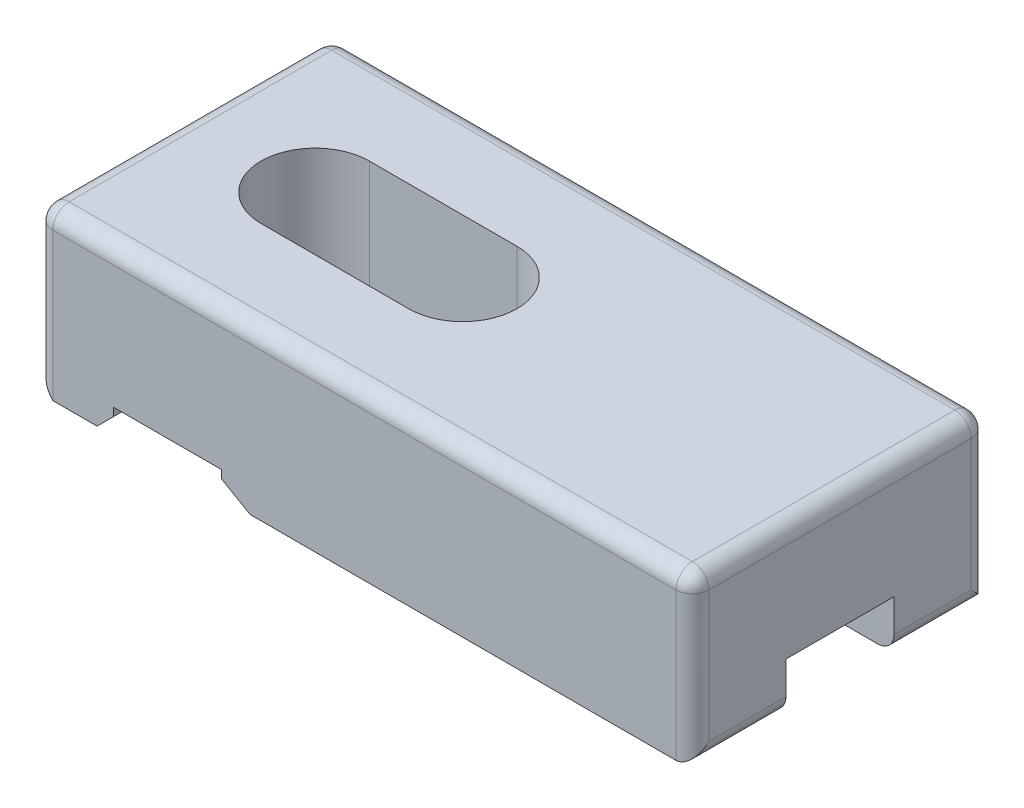
ISO-10303-21;
HEADER;
FILE_DESCRIPTION(('STEP AP214'),'2;1');
FILE_NAME('part.step','',(''),(''),'','','');
FILE_SCHEMA(('AUTOMOTIVE_DESIGN { 1 0 10303 214 1 1 1 1 }'));
ENDSEC;
DATA;
#1=APPLICATION_CONTEXT('core data for automotive mechanical design processes');
#2=APPLICATION_PROTOCOL_DEFINITION('international standard','automotive_design',2000,#1);
#3=PRODUCT_CONTEXT('',#1,'mechanical');
#4=PRODUCT('Part','Part','',(#3));
#5=PRODUCT_RELATED_PRODUCT_CATEGORY('part','',(#4));
#6=PRODUCT_DEFINITION_FORMATION('','',#4);
#7=PRODUCT_DEFINITION_CONTEXT('part definition',#1,'design');
#8=PRODUCT_DEFINITION('design','',#6,#7);
#9=PRODUCT_DEFINITION_SHAPE('','',#8);
#10=(LENGTH_UNIT() NAMED_UNIT(*) SI_UNIT(.MILLI.,.METRE.));
#11=(NAMED_UNIT(*) PLANE_ANGLE_UNIT() SI_UNIT($,.RADIAN.));
#12=(NAMED_UNIT(*) SI_UNIT($,.STERADIAN.) SOLID_ANGLE_UNIT());
#13=UNCERTAINTY_MEASURE_WITH_UNIT(LENGTH_MEASURE(1.E-05),#10,'distance_accuracy_value','');
#14=(GEOMETRIC_REPRESENTATION_CONTEXT(3) GLOBAL_UNCERTAINTY_ASSIGNED_CONTEXT((#13)) GLOBAL_UNIT_ASSIGNED_CONTEXT((#10,
#11,#12)) REPRESENTATION_CONTEXT('',''));
#15=CARTESIAN_POINT('',(0.,0.,0.));
#16=DIRECTION('',(0.,0.,1.));
#17=DIRECTION('',(1.,0.,0.));
#18=AXIS2_PLACEMENT_3D('',#15,#16,#17);
#19=CARTESIAN_POINT('',(0.,0.,0.));
#20=DIRECTION('',(0.,-1.,0.));
#21=DIRECTION('',(0.,0.,-1.));
#22=AXIS2_PLACEMENT_3D('',#19,#20,#21);
#23=PLANE('',#22);
#24=DIRECTION('',(-1.,0.,0.));
#25=VECTOR('',#24,1.);
#26=CARTESIAN_POINT('',(0.,0.,-5.7));
#27=LINE('',#26,#25);
#28=CARTESIAN_POINT('',(3.7,0.,-5.7));
#29=VERTEX_POINT('',#28);
#30=CARTESIAN_POINT('',(1.,0.,-5.7));
#31=VERTEX_POINT('',#30);
#32=EDGE_CURVE('E277',#29,#31,#27,.T.);
#33=ORIENTED_EDGE('',*,*,#32,.F.);
#34=DIRECTION('',(0.,0.,1.));
#35=VECTOR('',#34,1.);
#36=CARTESIAN_POINT('',(3.7,0.,0.));
#37=LINE('',#36,#35);
#38=CARTESIAN_POINT('',(3.7,0.,0.));
#39=VERTEX_POINT('',#38);
#40=EDGE_CURVE('E412',#29,#39,#37,.T.);
#41=ORIENTED_EDGE('',*,*,#40,.T.);
#42=DIRECTION('',(1.,0.,0.));
#43=VECTOR('',#42,1.);
#44=CARTESIAN_POINT('',(0.,0.,0.));
#45=LINE('',#44,#43);
#46=CARTESIAN_POINT('',(1.,0.,0.));
#47=VERTEX_POINT('',#46);
#48=EDGE_CURVE('E363',#47,#39,#45,.T.);
#49=ORIENTED_EDGE('',*,*,#48,.F.);
#50=DIRECTION('',(0.,0.,-1.));
#51=VECTOR('',#50,1.);
#52=CARTESIAN_POINT('',(1.,0.,-5.7));
#53=LINE('',#52,#51);
#54=EDGE_CURVE('E409',#47,#31,#53,.T.);
#55=ORIENTED_EDGE('',*,*,#54,.T.);
#56=EDGE_LOOP('',(#33,#41,#49,#55));
#57=FACE_BOUND('',#56,.T.);
#58=ADVANCED_FACE('F39',(#57),#23,.T.);
#59=DIRECTION('',(-1.,0.,0.));
#60=VECTOR('',#59,1.);
#61=CARTESIAN_POINT('',(0.,0.,-18.));
#62=LINE('',#61,#60);
#63=CARTESIAN_POINT('',(39.,0.,-18.));
#64=VERTEX_POINT('',#63);
#65=CARTESIAN_POINT('',(13.0320508075689,0.,-18.));
#66=VERTEX_POINT('',#65);
#67=EDGE_CURVE('E368',#64,#66,#62,.T.);
#68=ORIENTED_EDGE('',*,*,#67,.F.);
#69=DIRECTION('',(0.,0.,-1.));
#70=VECTOR('',#69,1.);
#71=CARTESIAN_POINT('',(39.,0.,-12.3));
#72=LINE('',#71,#70);
#73=CARTESIAN_POINT('',(39.,0.,-12.3));
#74=VERTEX_POINT('',#73);
#75=EDGE_CURVE('E65',#64,#74,#72,.F.);
#76=ORIENTED_EDGE('',*,*,#75,.T.);
#77=DIRECTION('',(-1.,0.,0.));
#78=VECTOR('',#77,1.);
#79=CARTESIAN_POINT('',(17.,0.,-12.3));
#80=LINE('',#79,#78);
#81=CARTESIAN_POINT('',(13.0320508075689,0.,-12.3));
#82=VERTEX_POINT('',#81);
#83=EDGE_CURVE('E327',#74,#82,#80,.T.);
#84=ORIENTED_EDGE('',*,*,#83,.T.);
#85=DIRECTION('',(0.,0.,-1.));
#86=VECTOR('',#85,1.);
#87=CARTESIAN_POINT('',(13.0320508075689,0.,-18.));
#88=LINE('',#87,#86);
#89=EDGE_CURVE('E432',#82,#66,#88,.T.);
#90=ORIENTED_EDGE('',*,*,#89,.T.);
#91=EDGE_LOOP('',(#68,#76,#84,#90));
#92=FACE_BOUND('',#91,.T.);
#93=ADVANCED_FACE('F723',(#92),#23,.T.);
#94=DIRECTION('',(1.,0.,0.));
#95=VECTOR('',#94,1.);
#96=CARTESIAN_POINT('',(17.,0.,-5.7));
#97=LINE('',#96,#95);
#98=CARTESIAN_POINT('',(13.0320508075689,0.,-5.7));
#99=VERTEX_POINT('',#98);
#100=CARTESIAN_POINT('',(39.,0.,-5.7));
#101=VERTEX_POINT('',#100);
#102=EDGE_CURVE('E332',#99,#101,#97,.T.);
#103=ORIENTED_EDGE('',*,*,#102,.T.);
#104=DIRECTION('',(0.,0.,-1.));
#105=VECTOR('',#104,1.);
#106=CARTESIAN_POINT('',(39.,0.,0.));
#107=LINE('',#106,#105);
#108=CARTESIAN_POINT('',(39.,0.,0.));
#109=VERTEX_POINT('',#108);
#110=EDGE_CURVE('E514',#101,#109,#107,.F.);
#111=ORIENTED_EDGE('',*,*,#110,.T.);
#112=CARTESIAN_POINT('',(13.0320508075689,0.,0.));
#113=VERTEX_POINT('',#112);
#114=EDGE_CURVE('E362',#113,#109,#45,.T.);
#115=ORIENTED_EDGE('',*,*,#114,.F.);
#116=DIRECTION('',(0.,0.,-1.));
#117=VECTOR('',#116,1.);
#118=CARTESIAN_POINT('',(13.0320508075689,0.,-5.7));
#119=LINE('',#118,#117);
#120=EDGE_CURVE('E446',#113,#99,#119,.T.);
#121=ORIENTED_EDGE('',*,*,#120,.T.);
#122=EDGE_LOOP('',(#103,#111,#115,#121));
#123=FACE_BOUND('',#122,.T.);
#124=ADVANCED_FACE('F728',(#123),#23,.T.);
#125=CARTESIAN_POINT('',(8.,10.,-9.));
#126=DIRECTION('',(0.,-1.,0.));
#127=DIRECTION('',(0.,0.,-1.));
#128=AXIS2_PLACEMENT_3D('',#125,#126,#127);
#129=CYLINDRICAL_SURFACE('',#128,3.3);
#130=DIRECTION('',(0.,-1.,0.));
#131=VECTOR('',#130,1.);
#132=CARTESIAN_POINT('',(8.,10.,-5.7));
#133=LINE('',#132,#131);
#134=CARTESIAN_POINT('',(8.,10.,-5.7));
#135=VERTEX_POINT('',#134);
#136=CARTESIAN_POINT('',(8.,1.5,-5.7));
#137=VERTEX_POINT('',#136);
#138=EDGE_CURVE('E350',#135,#137,#133,.T.);
#139=ORIENTED_EDGE('',*,*,#138,.T.);
#140=CARTESIAN_POINT('',(8.,1.5,-9.));
#141=DIRECTION('',(0.,-1.,0.));
#142=DIRECTION('',(0.,0.,-1.));
#143=AXIS2_PLACEMENT_3D('',#140,#141,#142);
#144=CIRCLE('',#143,3.3);
#145=CARTESIAN_POINT('',(8.,1.5,-12.3));
#146=VERTEX_POINT('',#145);
#147=EDGE_CURVE('E294',#137,#146,#144,.T.);
#148=ORIENTED_EDGE('',*,*,#147,.T.);
#149=DIRECTION('',(0.,-1.,0.));
#150=VECTOR('',#149,1.);
#151=CARTESIAN_POINT('',(8.,10.,-12.3));
#152=LINE('',#151,#150);
#153=CARTESIAN_POINT('',(8.,10.,-12.3));
#154=VERTEX_POINT('',#153);
#155=EDGE_CURVE('E354',#154,#146,#152,.T.);
#156=ORIENTED_EDGE('',*,*,#155,.F.);
#157=CARTESIAN_POINT('',(8.,10.,-9.));
#158=DIRECTION('',(0.,1.,0.));
#159=DIRECTION('',(0.,0.,1.));
#160=AXIS2_PLACEMENT_3D('',#157,#158,#159);
#161=CIRCLE('',#160,3.3);
#162=EDGE_CURVE('E335',#154,#135,#161,.T.);
#163=ORIENTED_EDGE('',*,*,#162,.T.);
#164=EDGE_LOOP('',(#139,#148,#156,#163));
#165=FACE_BOUND('',#164,.T.);
#166=ADVANCED_FACE('F739',(#165),#129,.F.);
#167=CARTESIAN_POINT('',(17.,10.,-9.));
#168=DIRECTION('',(0.,-1.,0.));
#169=DIRECTION('',(0.,0.,-1.));
#170=AXIS2_PLACEMENT_3D('',#167,#168,#169);
#171=CYLINDRICAL_SURFACE('',#170,3.3);
#172=DIRECTION('',(0.,-1.,0.));
#173=VECTOR('',#172,1.);
#174=CARTESIAN_POINT('',(17.,10.,-12.3));
#175=LINE('',#174,#173);
#176=CARTESIAN_POINT('',(17.,10.,-12.3));
#177=VERTEX_POINT('',#176);
#178=CARTESIAN_POINT('',(17.,3.,-12.3));
#179=VERTEX_POINT('',#178);
#180=EDGE_CURVE('E358',#177,#179,#175,.T.);
#181=ORIENTED_EDGE('',*,*,#180,.T.);
#182=CARTESIAN_POINT('',(17.,3.,-9.));
#183=DIRECTION('',(0.,-1.,0.));
#184=DIRECTION('',(0.,0.,-1.));
#185=AXIS2_PLACEMENT_3D('',#182,#183,#184);
#186=CIRCLE('',#185,3.3);
#187=CARTESIAN_POINT('',(17.,3.,-5.7));
#188=VERTEX_POINT('',#187);
#189=EDGE_CURVE('E320',#179,#188,#186,.T.);
#190=ORIENTED_EDGE('',*,*,#189,.T.);
#191=DIRECTION('',(0.,-1.,0.));
#192=VECTOR('',#191,1.);
#193=CARTESIAN_POINT('',(17.,10.,-5.7));
#194=LINE('',#193,#192);
#195=CARTESIAN_POINT('',(17.,10.,-5.7));
#196=VERTEX_POINT('',#195);
#197=EDGE_CURVE('E342',#196,#188,#194,.T.);
#198=ORIENTED_EDGE('',*,*,#197,.F.);
#199=CARTESIAN_POINT('',(17.,10.,-9.));
#200=DIRECTION('',(0.,1.,0.));
#201=DIRECTION('',(0.,0.,1.));
#202=AXIS2_PLACEMENT_3D('',#199,#200,#201);
#203=CIRCLE('',#202,3.3);
#204=EDGE_CURVE('E328',#196,#177,#203,.T.);
#205=ORIENTED_EDGE('',*,*,#204,.T.);
#206=EDGE_LOOP('',(#181,#190,#198,#205));
#207=FACE_BOUND('',#206,.T.);
#208=ADVANCED_FACE('F737',(#207),#171,.F.);
#209=CARTESIAN_POINT('',(0.,10.,0.));
#210=DIRECTION('',(0.,-1.,0.));
#211=DIRECTION('',(0.,0.,-1.));
#212=AXIS2_PLACEMENT_3D('',#209,#210,#211);
#213=PLANE('',#212);
#214=DIRECTION('',(-1.,0.,0.));
#215=VECTOR('',#214,1.);
#216=CARTESIAN_POINT('',(0.,10.,-17.));
#217=LINE('',#216,#215);
#218=CARTESIAN_POINT('',(39.,10.,-17.));
#219=VERTEX_POINT('',#218);
#220=CARTESIAN_POINT('',(1.,10.,-17.));
#221=VERTEX_POINT('',#220);
#222=EDGE_CURVE('E458',#219,#221,#217,.T.);
#223=ORIENTED_EDGE('',*,*,#222,.T.);
#224=DIRECTION('',(0.,0.,1.));
#225=VECTOR('',#224,1.);
#226=CARTESIAN_POINT('',(1.,10.,0.));
#227=LINE('',#226,#225);
#228=CARTESIAN_POINT('',(1.,10.,-1.));
#229=VERTEX_POINT('',#228);
#230=EDGE_CURVE('E461',#221,#229,#227,.T.);
#231=ORIENTED_EDGE('',*,*,#230,.T.);
#232=DIRECTION('',(1.,0.,0.));
#233=VECTOR('',#232,1.);
#234=CARTESIAN_POINT('',(0.,10.,-1.));
#235=LINE('',#234,#233);
#236=CARTESIAN_POINT('',(39.,10.,-1.));
#237=VERTEX_POINT('',#236);
#238=EDGE_CURVE('E452',#229,#237,#235,.T.);
#239=ORIENTED_EDGE('',*,*,#238,.T.);
#240=DIRECTION('',(0.,0.,-1.));
#241=VECTOR('',#240,1.);
#242=CARTESIAN_POINT('',(39.,10.,0.));
#243=LINE('',#242,#241);
#244=EDGE_CURVE('E455',#237,#219,#243,.T.);
#245=ORIENTED_EDGE('',*,*,#244,.T.);
#246=EDGE_LOOP('',(#223,#231,#239,#245));
#247=FACE_BOUND('',#246,.T.);
#248=ORIENTED_EDGE('',*,*,#204,.F.);
#249=DIRECTION('',(1.,0.,0.));
#250=VECTOR('',#249,1.);
#251=CARTESIAN_POINT('',(17.,10.,-5.7));
#252=LINE('',#251,#250);
#253=EDGE_CURVE('E339',#135,#196,#252,.T.);
#254=ORIENTED_EDGE('',*,*,#253,.F.);
#255=ORIENTED_EDGE('',*,*,#162,.F.);
#256=DIRECTION('',(-1.,0.,0.));
#257=VECTOR('',#256,1.);
#258=CARTESIAN_POINT('',(17.,10.,-12.3));
#259=LINE('',#258,#257);
#260=EDGE_CURVE('E331',#177,#154,#259,.T.);
#261=ORIENTED_EDGE('',*,*,#260,.F.);
#262=EDGE_LOOP('',(#248,#254,#255,#261));
#263=FACE_BOUND('',#262,.T.);
#264=ADVANCED_FACE('F664',(#247,#263),#213,.F.);
#265=CARTESIAN_POINT('',(3.7,0.,-18.));
#266=VERTEX_POINT('',#265);
#267=CARTESIAN_POINT('',(1.,0.,-18.));
#268=VERTEX_POINT('',#267);
#269=EDGE_CURVE('E367',#266,#268,#62,.T.);
#270=ORIENTED_EDGE('',*,*,#269,.F.);
#271=DIRECTION('',(0.,0.,1.));
#272=VECTOR('',#271,1.);
#273=CARTESIAN_POINT('',(3.7,0.,-12.3));
#274=LINE('',#273,#272);
#275=CARTESIAN_POINT('',(3.7,0.,-12.3));
#276=VERTEX_POINT('',#275);
#277=EDGE_CURVE('E390',#266,#276,#274,.T.);
#278=ORIENTED_EDGE('',*,*,#277,.T.);
#279=DIRECTION('',(1.,0.,0.));
#280=VECTOR('',#279,1.);
#281=CARTESIAN_POINT('',(0.,0.,-12.3));
#282=LINE('',#281,#280);
#283=CARTESIAN_POINT('',(1.,0.,-12.3));
#284=VERTEX_POINT('',#283);
#285=EDGE_CURVE('E573',#284,#276,#282,.T.);
#286=ORIENTED_EDGE('',*,*,#285,.F.);
#287=DIRECTION('',(0.,0.,-1.));
#288=VECTOR('',#287,1.);
#289=CARTESIAN_POINT('',(1.,0.,-18.));
#290=LINE('',#289,#288);
#291=EDGE_CURVE('E386',#284,#268,#290,.T.);
#292=ORIENTED_EDGE('',*,*,#291,.T.);
#293=EDGE_LOOP('',(#270,#278,#286,#292));
#294=FACE_BOUND('',#293,.T.);
#295=ADVANCED_FACE('F683',(#294),#23,.T.);
#296=CARTESIAN_POINT('',(0.,10.,0.));
#297=DIRECTION('',(1.,0.,0.));
#298=DIRECTION('',(0.,0.,-1.));
#299=AXIS2_PLACEMENT_3D('',#296,#297,#298);
#300=PLANE('',#299);
#301=DIRECTION('',(0.,0.,1.));
#302=VECTOR('',#301,1.);
#303=CARTESIAN_POINT('',(0.,9.,0.));
#304=LINE('',#303,#302);
#305=CARTESIAN_POINT('',(0.,9.,-1.));
#306=VERTEX_POINT('',#305);
#307=CARTESIAN_POINT('',(0.,9.,-17.));
#308=VERTEX_POINT('',#307);
#309=EDGE_CURVE('E468',#306,#308,#304,.F.);
#310=ORIENTED_EDGE('',*,*,#309,.T.);
#311=DIRECTION('',(0.,-1.,0.));
#312=VECTOR('',#311,1.);
#313=CARTESIAN_POINT('',(0.,10.,-17.));
#314=LINE('',#313,#312);
#315=CARTESIAN_POINT('',(0.,1.,-17.));
#316=VERTEX_POINT('',#315);
#317=EDGE_CURVE('E471',#308,#316,#314,.T.);
#318=ORIENTED_EDGE('',*,*,#317,.T.);
#319=DIRECTION('',(0.,0.,1.));
#320=VECTOR('',#319,1.);
#321=CARTESIAN_POINT('',(0.,1.,-12.3));
#322=LINE('',#321,#320);
#323=CARTESIAN_POINT('',(0.,1.,-12.3));
#324=VERTEX_POINT('',#323);
#325=EDGE_CURVE('E282',#316,#324,#322,.T.);
#326=ORIENTED_EDGE('',*,*,#325,.T.);
#327=DIRECTION('',(0.,-1.,0.));
#328=VECTOR('',#327,1.);
#329=CARTESIAN_POINT('',(0.,1.5,-12.3));
#330=LINE('',#329,#328);
#331=CARTESIAN_POINT('',(0.,1.5,-12.3));
#332=VERTEX_POINT('',#331);
#333=EDGE_CURVE('E258',#332,#324,#330,.T.);
#334=ORIENTED_EDGE('',*,*,#333,.F.);
#335=DIRECTION('',(0.,0.,-1.));
#336=VECTOR('',#335,1.);
#337=CARTESIAN_POINT('',(0.,1.5,-5.7));
#338=LINE('',#337,#336);
#339=CARTESIAN_POINT('',(0.,1.5,-5.7));
#340=VERTEX_POINT('',#339);
#341=EDGE_CURVE('E266',#340,#332,#338,.T.);
#342=ORIENTED_EDGE('',*,*,#341,.F.);
#343=DIRECTION('',(0.,-1.,0.));
#344=VECTOR('',#343,1.);
#345=CARTESIAN_POINT('',(0.,1.5,-5.7));
#346=LINE('',#345,#344);
#347=CARTESIAN_POINT('',(0.,1.,-5.7));
#348=VERTEX_POINT('',#347);
#349=EDGE_CURVE('E299',#340,#348,#346,.T.);
#350=ORIENTED_EDGE('',*,*,#349,.T.);
#351=DIRECTION('',(0.,0.,1.));
#352=VECTOR('',#351,1.);
#353=CARTESIAN_POINT('',(0.,1.,0.));
#354=LINE('',#353,#352);
#355=CARTESIAN_POINT('',(0.,1.,-1.));
#356=VERTEX_POINT('',#355);
#357=EDGE_CURVE('E420',#348,#356,#354,.T.);
#358=ORIENTED_EDGE('',*,*,#357,.T.);
#359=DIRECTION('',(0.,-1.,0.));
#360=VECTOR('',#359,1.);
#361=CARTESIAN_POINT('',(0.,10.,-1.));
#362=LINE('',#361,#360);
#363=EDGE_CURVE('E465',#356,#306,#362,.F.);
#364=ORIENTED_EDGE('',*,*,#363,.T.);
#365=EDGE_LOOP('',(#310,#318,#326,#334,#342,#350,#358,#364));
#366=FACE_BOUND('',#365,.T.);
#367=ADVANCED_FACE('F280',(#366),#300,.F.);
#368=CARTESIAN_POINT('',(0.,10.,0.));
#369=DIRECTION('',(0.,0.,-1.));
#370=DIRECTION('',(-1.,0.,0.));
#371=AXIS2_PLACEMENT_3D('',#368,#369,#370);
#372=PLANE('',#371);
#373=ORIENTED_EDGE('',*,*,#114,.T.);
#374=DIRECTION('',(0.,-1.,0.));
#375=VECTOR('',#374,1.);
#376=CARTESIAN_POINT('',(39.,10.,0.));
#377=LINE('',#376,#375);
#378=CARTESIAN_POINT('',(39.,9.,0.));
#379=VERTEX_POINT('',#378);
#380=EDGE_CURVE('E504',#109,#379,#377,.F.);
#381=ORIENTED_EDGE('',*,*,#380,.T.);
#382=DIRECTION('',(1.,0.,0.));
#383=VECTOR('',#382,1.);
#384=CARTESIAN_POINT('',(0.,9.,0.));
#385=LINE('',#384,#383);
#386=CARTESIAN_POINT('',(1.,9.,0.));
#387=VERTEX_POINT('',#386);
#388=EDGE_CURVE('E501',#379,#387,#385,.F.);
#389=ORIENTED_EDGE('',*,*,#388,.T.);
#390=DIRECTION('',(0.,-1.,0.));
#391=VECTOR('',#390,1.);
#392=CARTESIAN_POINT('',(1.,10.,0.));
#393=LINE('',#392,#391);
#394=EDGE_CURVE('E498',#387,#47,#393,.T.);
#395=ORIENTED_EDGE('',*,*,#394,.T.);
#396=ORIENTED_EDGE('',*,*,#48,.T.);
#397=DIRECTION('',(0.707106781186548,0.707106781186548,0.));
#398=VECTOR('',#397,1.);
#399=CARTESIAN_POINT('',(4.7,1.,0.));
#400=LINE('',#399,#398);
#401=CARTESIAN_POINT('',(4.7,1.,0.));
#402=VERTEX_POINT('',#401);
#403=EDGE_CURVE('E415',#39,#402,#400,.T.);
#404=ORIENTED_EDGE('',*,*,#403,.T.);
#405=DIRECTION('',(0.,-1.,0.));
#406=VECTOR('',#405,1.);
#407=CARTESIAN_POINT('',(4.7,1.5,0.));
#408=LINE('',#407,#406);
#409=CARTESIAN_POINT('',(4.7,1.5,0.));
#410=VERTEX_POINT('',#409);
#411=EDGE_CURVE('E593',#410,#402,#408,.T.);
#412=ORIENTED_EDGE('',*,*,#411,.F.);
#413=DIRECTION('',(-1.,0.,0.));
#414=VECTOR('',#413,1.);
#415=CARTESIAN_POINT('',(4.7,1.5,0.));
#416=LINE('',#415,#414);
#417=CARTESIAN_POINT('',(11.3,1.5,0.));
#418=VERTEX_POINT('',#417);
#419=EDGE_CURVE('E627',#418,#410,#416,.T.);
#420=ORIENTED_EDGE('',*,*,#419,.F.);
#421=DIRECTION('',(0.,-1.,0.));
#422=VECTOR('',#421,1.);
#423=CARTESIAN_POINT('',(11.3,1.5,0.));
#424=LINE('',#423,#422);
#425=CARTESIAN_POINT('',(11.3,1.,0.));
#426=VERTEX_POINT('',#425);
#427=EDGE_CURVE('E597',#418,#426,#424,.T.);
#428=ORIENTED_EDGE('',*,*,#427,.T.);
#429=DIRECTION('',(0.866025403784438,-0.500000000000001,0.));
#430=VECTOR('',#429,1.);
#431=CARTESIAN_POINT('',(11.3,1.,0.));
#432=LINE('',#431,#430);
#433=EDGE_CURVE('E443',#426,#113,#432,.T.);
#434=ORIENTED_EDGE('',*,*,#433,.T.);
#435=EDGE_LOOP('',(#373,#381,#389,#395,#396,#404,#412,#420,#428,#434));
#436=FACE_BOUND('',#435,.T.);
#437=ADVANCED_FACE('F690',(#436),#372,.F.);
#438=CARTESIAN_POINT('',(40.,10.,0.));
#439=DIRECTION('',(-1.,0.,0.));
#440=DIRECTION('',(0.,0.,1.));
#441=AXIS2_PLACEMENT_3D('',#438,#439,#440);
#442=PLANE('',#441);
#443=DIRECTION('',(0.,-1.,0.));
#444=VECTOR('',#443,1.);
#445=CARTESIAN_POINT('',(40.,10.,-1.));
#446=LINE('',#445,#444);
#447=CARTESIAN_POINT('',(40.,9.,-1.));
#448=VERTEX_POINT('',#447);
#449=CARTESIAN_POINT('',(40.,0.999999999999999,-1.));
#450=VERTEX_POINT('',#449);
#451=EDGE_CURVE('E492',#448,#450,#446,.T.);
#452=ORIENTED_EDGE('',*,*,#451,.T.);
#453=DIRECTION('',(0.,0.,-1.));
#454=VECTOR('',#453,1.);
#455=CARTESIAN_POINT('',(40.,0.999999999999999,-5.7));
#456=LINE('',#455,#454);
#457=CARTESIAN_POINT('',(40.,0.999999999999999,-5.7));
#458=VERTEX_POINT('',#457);
#459=EDGE_CURVE('E495',#450,#458,#456,.T.);
#460=ORIENTED_EDGE('',*,*,#459,.T.);
#461=DIRECTION('',(0.,-1.,0.));
#462=VECTOR('',#461,1.);
#463=CARTESIAN_POINT('',(40.,3.,-5.7));
#464=LINE('',#463,#462);
#465=CARTESIAN_POINT('',(40.,3.,-5.7));
#466=VERTEX_POINT('',#465);
#467=EDGE_CURVE('E317',#466,#458,#464,.T.);
#468=ORIENTED_EDGE('',*,*,#467,.F.);
#469=DIRECTION('',(0.,0.,1.));
#470=VECTOR('',#469,1.);
#471=CARTESIAN_POINT('',(40.,3.,-5.7));
#472=LINE('',#471,#470);
#473=CARTESIAN_POINT('',(40.,3.,-12.3));
#474=VERTEX_POINT('',#473);
#475=EDGE_CURVE('E312',#474,#466,#472,.T.);
#476=ORIENTED_EDGE('',*,*,#475,.F.);
#477=DIRECTION('',(0.,-1.,0.));
#478=VECTOR('',#477,1.);
#479=CARTESIAN_POINT('',(40.,3.,-12.3));
#480=LINE('',#479,#478);
#481=CARTESIAN_POINT('',(40.,0.999999999999999,-12.3));
#482=VERTEX_POINT('',#481);
#483=EDGE_CURVE('E316',#474,#482,#480,.T.);
#484=ORIENTED_EDGE('',*,*,#483,.T.);
#485=DIRECTION('',(0.,0.,-1.));
#486=VECTOR('',#485,1.);
#487=CARTESIAN_POINT('',(40.,0.999999999999999,-18.));
#488=LINE('',#487,#486);
#489=CARTESIAN_POINT('',(40.,0.999999999999999,-17.));
#490=VERTEX_POINT('',#489);
#491=EDGE_CURVE('E486',#482,#490,#488,.T.);
#492=ORIENTED_EDGE('',*,*,#491,.T.);
#493=DIRECTION('',(0.,-1.,0.));
#494=VECTOR('',#493,1.);
#495=CARTESIAN_POINT('',(40.,10.,-17.));
#496=LINE('',#495,#494);
#497=CARTESIAN_POINT('',(40.,9.,-17.));
#498=VERTEX_POINT('',#497);
#499=EDGE_CURVE('E483',#490,#498,#496,.F.);
#500=ORIENTED_EDGE('',*,*,#499,.T.);
#501=DIRECTION('',(0.,0.,-1.));
#502=VECTOR('',#501,1.);
#503=CARTESIAN_POINT('',(40.,9.,0.));
#504=LINE('',#503,#502);
#505=EDGE_CURVE('E489',#498,#448,#504,.F.);
#506=ORIENTED_EDGE('',*,*,#505,.T.);
#507=EDGE_LOOP('',(#452,#460,#468,#476,#484,#492,#500,#506));
#508=FACE_BOUND('',#507,.T.);
#509=ADVANCED_FACE('F772',(#508),#442,.F.);
#510=CARTESIAN_POINT('',(0.,10.,-18.));
#511=DIRECTION('',(0.,0.,1.));
#512=DIRECTION('',(1.,0.,0.));
#513=AXIS2_PLACEMENT_3D('',#510,#511,#512);
#514=PLANE('',#513);
#515=DIRECTION('',(-1.,0.,0.));
#516=VECTOR('',#515,1.);
#517=CARTESIAN_POINT('',(0.,9.,-18.));
#518=LINE('',#517,#516);
#519=CARTESIAN_POINT('',(1.,9.,-18.));
#520=VERTEX_POINT('',#519);
#521=CARTESIAN_POINT('',(39.,9.,-18.));
#522=VERTEX_POINT('',#521);
#523=EDGE_CURVE('E477',#520,#522,#518,.F.);
#524=ORIENTED_EDGE('',*,*,#523,.T.);
#525=DIRECTION('',(0.,-1.,0.));
#526=VECTOR('',#525,1.);
#527=CARTESIAN_POINT('',(39.,10.,-18.));
#528=LINE('',#527,#526);
#529=EDGE_CURVE('E480',#522,#64,#528,.T.);
#530=ORIENTED_EDGE('',*,*,#529,.T.);
#531=ORIENTED_EDGE('',*,*,#67,.T.);
#532=DIRECTION('',(-0.866025403784438,0.500000000000001,0.));
#533=VECTOR('',#532,1.);
#534=CARTESIAN_POINT('',(11.3,1.00000000000001,-18.));
#535=LINE('',#534,#533);
#536=CARTESIAN_POINT('',(11.3,1.,-18.));
#537=VERTEX_POINT('',#536);
#538=EDGE_CURVE('E436',#66,#537,#535,.T.);
#539=ORIENTED_EDGE('',*,*,#538,.T.);
#540=DIRECTION('',(0.,-1.,0.));
#541=VECTOR('',#540,1.);
#542=CARTESIAN_POINT('',(11.3,1.5,-18.));
#543=LINE('',#542,#541);
#544=CARTESIAN_POINT('',(11.3,1.5,-18.));
#545=VERTEX_POINT('',#544);
#546=EDGE_CURVE('E601',#545,#537,#543,.T.);
#547=ORIENTED_EDGE('',*,*,#546,.F.);
#548=DIRECTION('',(1.,0.,0.));
#549=VECTOR('',#548,1.);
#550=CARTESIAN_POINT('',(4.7,1.5,-18.));
#551=LINE('',#550,#549);
#552=CARTESIAN_POINT('',(4.7,1.5,-18.));
#553=VERTEX_POINT('',#552);
#554=EDGE_CURVE('E613',#553,#545,#551,.T.);
#555=ORIENTED_EDGE('',*,*,#554,.F.);
#556=DIRECTION('',(0.,-1.,0.));
#557=VECTOR('',#556,1.);
#558=CARTESIAN_POINT('',(4.7,1.5,-18.));
#559=LINE('',#558,#557);
#560=CARTESIAN_POINT('',(4.7,1.,-18.));
#561=VERTEX_POINT('',#560);
#562=EDGE_CURVE('E288',#553,#561,#559,.T.);
#563=ORIENTED_EDGE('',*,*,#562,.T.);
#564=DIRECTION('',(-0.707106781186548,-0.707106781186548,0.));
#565=VECTOR('',#564,1.);
#566=CARTESIAN_POINT('',(4.7,1.,-18.));
#567=LINE('',#566,#565);
#568=EDGE_CURVE('E383',#561,#266,#567,.T.);
#569=ORIENTED_EDGE('',*,*,#568,.T.);
#570=ORIENTED_EDGE('',*,*,#269,.T.);
#571=DIRECTION('',(0.,-1.,0.));
#572=VECTOR('',#571,1.);
#573=CARTESIAN_POINT('',(1.,10.,-18.));
#574=LINE('',#573,#572);
#575=EDGE_CURVE('E474',#268,#520,#574,.F.);
#576=ORIENTED_EDGE('',*,*,#575,.T.);
#577=EDGE_LOOP('',(#524,#530,#531,#539,#547,#555,#563,#569,#570,#576));
#578=FACE_BOUND('',#577,.T.);
#579=ADVANCED_FACE('F608',(#578),#514,.F.);
#580=CARTESIAN_POINT('',(17.,10.,-12.3));
#581=DIRECTION('',(0.,0.,1.));
#582=DIRECTION('',(1.,0.,0.));
#583=AXIS2_PLACEMENT_3D('',#580,#581,#582);
#584=PLANE('',#583);
#585=ORIENTED_EDGE('',*,*,#83,.F.);
#586=CARTESIAN_POINT('',(39.,0.999999999999999,-12.3));
#587=DIRECTION('',(0.,0.,1.));
#588=DIRECTION('',(1.,0.,0.));
#589=AXIS2_PLACEMENT_3D('',#586,#587,#588);
#590=CIRCLE('',#589,1.);
#591=EDGE_CURVE('E509',#74,#482,#590,.T.);
#592=ORIENTED_EDGE('',*,*,#591,.T.);
#593=ORIENTED_EDGE('',*,*,#483,.F.);
#594=DIRECTION('',(1.,0.,0.));
#595=VECTOR('',#594,1.);
#596=CARTESIAN_POINT('',(40.,3.,-12.3));
#597=LINE('',#596,#595);
#598=EDGE_CURVE('E309',#179,#474,#597,.T.);
#599=ORIENTED_EDGE('',*,*,#598,.F.);
#600=ORIENTED_EDGE('',*,*,#180,.F.);
#601=ORIENTED_EDGE('',*,*,#260,.T.);
#602=ORIENTED_EDGE('',*,*,#155,.T.);
#603=DIRECTION('',(1.,0.,0.));
#604=VECTOR('',#603,1.);
#605=CARTESIAN_POINT('',(17.,1.5,-12.3));
#606=LINE('',#605,#604);
#607=CARTESIAN_POINT('',(11.3,1.5,-12.3));
#608=VERTEX_POINT('',#607);
#609=EDGE_CURVE('E298',#146,#608,#606,.T.);
#610=ORIENTED_EDGE('',*,*,#609,.T.);
#611=DIRECTION('',(0.,1.,0.));
#612=VECTOR('',#611,1.);
#613=CARTESIAN_POINT('',(11.3,10.,-12.3));
#614=LINE('',#613,#612);
#615=CARTESIAN_POINT('',(11.3,1.,-12.3));
#616=VERTEX_POINT('',#615);
#617=EDGE_CURVE('E303',#616,#608,#614,.T.);
#618=ORIENTED_EDGE('',*,*,#617,.F.);
#619=DIRECTION('',(0.866025403784438,-0.500000000000001,0.));
#620=VECTOR('',#619,1.);
#621=CARTESIAN_POINT('',(11.67788568297,0.781827599214359,-12.3));
#622=LINE('',#621,#620);
#623=EDGE_CURVE('E428',#616,#82,#622,.T.);
#624=ORIENTED_EDGE('',*,*,#623,.T.);
#625=EDGE_LOOP('',(#585,#592,#593,#599,#600,#601,#602,#610,#618,#624));
#626=FACE_BOUND('',#625,.T.);
#627=ADVANCED_FACE('F766',(#626),#584,.T.);
#628=CARTESIAN_POINT('',(17.,10.,-5.7));
#629=DIRECTION('',(0.,0.,-1.));
#630=DIRECTION('',(-1.,0.,0.));
#631=AXIS2_PLACEMENT_3D('',#628,#629,#630);
#632=PLANE('',#631);
#633=ORIENTED_EDGE('',*,*,#467,.T.);
#634=CARTESIAN_POINT('',(39.,0.999999999999999,-5.7));
#635=DIRECTION('',(0.,0.,-1.));
#636=DIRECTION('',(-1.,0.,0.));
#637=AXIS2_PLACEMENT_3D('',#634,#635,#636);
#638=CIRCLE('',#637,1.);
#639=EDGE_CURVE('E57',#458,#101,#638,.T.);
#640=ORIENTED_EDGE('',*,*,#639,.T.);
#641=ORIENTED_EDGE('',*,*,#102,.F.);
#642=DIRECTION('',(-0.866025403784438,0.500000000000001,0.));
#643=VECTOR('',#642,1.);
#644=CARTESIAN_POINT('',(11.67788568297,0.781827599214359,-5.7));
#645=LINE('',#644,#643);
#646=CARTESIAN_POINT('',(11.3,1.,-5.7));
#647=VERTEX_POINT('',#646);
#648=EDGE_CURVE('E449',#99,#647,#645,.T.);
#649=ORIENTED_EDGE('',*,*,#648,.T.);
#650=DIRECTION('',(0.,-1.,0.));
#651=VECTOR('',#650,1.);
#652=CARTESIAN_POINT('',(11.3,10.,-5.7));
#653=LINE('',#652,#651);
#654=CARTESIAN_POINT('',(11.3,1.5,-5.7));
#655=VERTEX_POINT('',#654);
#656=EDGE_CURVE('E375',#655,#647,#653,.T.);
#657=ORIENTED_EDGE('',*,*,#656,.F.);
#658=DIRECTION('',(-1.,0.,0.));
#659=VECTOR('',#658,1.);
#660=CARTESIAN_POINT('',(17.,1.5,-5.7));
#661=LINE('',#660,#659);
#662=EDGE_CURVE('E371',#655,#137,#661,.T.);
#663=ORIENTED_EDGE('',*,*,#662,.T.);
#664=ORIENTED_EDGE('',*,*,#138,.F.);
#665=ORIENTED_EDGE('',*,*,#253,.T.);
#666=ORIENTED_EDGE('',*,*,#197,.T.);
#667=DIRECTION('',(-1.,0.,0.));
#668=VECTOR('',#667,1.);
#669=CARTESIAN_POINT('',(8.,3.,-5.7));
#670=LINE('',#669,#668);
#671=EDGE_CURVE('E306',#466,#188,#670,.T.);
#672=ORIENTED_EDGE('',*,*,#671,.F.);
#673=EDGE_LOOP('',(#633,#640,#641,#649,#657,#663,#664,#665,#666,#672));
#674=FACE_BOUND('',#673,.T.);
#675=ADVANCED_FACE('F746',(#674),#632,.T.);
#676=CARTESIAN_POINT('',(8.,3.,-9.));
#677=DIRECTION('',(0.,-1.,0.));
#678=DIRECTION('',(0.,0.,-1.));
#679=AXIS2_PLACEMENT_3D('',#676,#677,#678);
#680=PLANE('',#679);
#681=ORIENTED_EDGE('',*,*,#598,.T.);
#682=ORIENTED_EDGE('',*,*,#475,.T.);
#683=ORIENTED_EDGE('',*,*,#671,.T.);
#684=ORIENTED_EDGE('',*,*,#189,.F.);
#685=EDGE_LOOP('',(#681,#682,#683,#684));
#686=FACE_BOUND('',#685,.T.);
#687=ADVANCED_FACE('F763',(#686),#680,.T.);
#688=CARTESIAN_POINT('',(11.3,1.5,0.));
#689=DIRECTION('',(1.,0.,0.));
#690=DIRECTION('',(0.,0.,-1.));
#691=AXIS2_PLACEMENT_3D('',#688,#689,#690);
#692=PLANE('',#691);
#693=ORIENTED_EDGE('',*,*,#546,.T.);
#694=DIRECTION('',(0.,0.,1.));
#695=VECTOR('',#694,1.);
#696=CARTESIAN_POINT('',(11.3,1.,-12.3));
#697=LINE('',#696,#695);
#698=EDGE_CURVE('E424',#537,#616,#697,.T.);
#699=ORIENTED_EDGE('',*,*,#698,.T.);
#700=ORIENTED_EDGE('',*,*,#617,.T.);
#701=DIRECTION('',(0.,0.,1.));
#702=VECTOR('',#701,1.);
#703=CARTESIAN_POINT('',(11.3,1.5,0.));
#704=LINE('',#703,#702);
#705=EDGE_CURVE('E624',#545,#608,#704,.T.);
#706=ORIENTED_EDGE('',*,*,#705,.F.);
#707=EDGE_LOOP('',(#693,#699,#700,#706));
#708=FACE_BOUND('',#707,.T.);
#709=ADVANCED_FACE('F720',(#708),#692,.F.);
#710=CARTESIAN_POINT('',(0.,1.5,-5.7));
#711=DIRECTION('',(0.,0.,1.));
#712=DIRECTION('',(1.,0.,0.));
#713=AXIS2_PLACEMENT_3D('',#710,#711,#712);
#714=PLANE('',#713);
#715=DIRECTION('',(0.,-1.,0.));
#716=VECTOR('',#715,1.);
#717=CARTESIAN_POINT('',(4.7,1.5,-5.7));
#718=LINE('',#717,#716);
#719=CARTESIAN_POINT('',(4.7,1.5,-5.7));
#720=VERTEX_POINT('',#719);
#721=CARTESIAN_POINT('',(4.7,1.,-5.7));
#722=VERTEX_POINT('',#721);
#723=EDGE_CURVE('E589',#720,#722,#718,.T.);
#724=ORIENTED_EDGE('',*,*,#723,.T.);
#725=DIRECTION('',(-0.707106781186548,-0.707106781186548,0.));
#726=VECTOR('',#725,1.);
#727=CARTESIAN_POINT('',(4.7,1.,-5.7));
#728=LINE('',#727,#726);
#729=EDGE_CURVE('E406',#722,#29,#728,.T.);
#730=ORIENTED_EDGE('',*,*,#729,.T.);
#731=ORIENTED_EDGE('',*,*,#32,.T.);
#732=DIRECTION('',(-0.707106781186548,0.707106781186548,0.));
#733=VECTOR('',#732,1.);
#734=CARTESIAN_POINT('',(0.,1.,-5.7));
#735=LINE('',#734,#733);
#736=EDGE_CURVE('E403',#31,#348,#735,.T.);
#737=ORIENTED_EDGE('',*,*,#736,.T.);
#738=ORIENTED_EDGE('',*,*,#349,.F.);
#739=DIRECTION('',(-1.,0.,0.));
#740=VECTOR('',#739,1.);
#741=CARTESIAN_POINT('',(0.,1.5,-5.7));
#742=LINE('',#741,#740);
#743=EDGE_CURVE('E273',#720,#340,#742,.T.);
#744=ORIENTED_EDGE('',*,*,#743,.F.);
#745=EDGE_LOOP('',(#724,#730,#731,#737,#738,#744));
#746=FACE_BOUND('',#745,.T.);
#747=ADVANCED_FACE('F635',(#746),#714,.F.);
#748=CARTESIAN_POINT('',(4.7,1.5,0.));
#749=DIRECTION('',(-1.,0.,0.));
#750=DIRECTION('',(0.,0.,1.));
#751=AXIS2_PLACEMENT_3D('',#748,#749,#750);
#752=PLANE('',#751);
#753=ORIENTED_EDGE('',*,*,#411,.T.);
#754=DIRECTION('',(0.,0.,-1.));
#755=VECTOR('',#754,1.);
#756=CARTESIAN_POINT('',(4.7,1.,-5.7));
#757=LINE('',#756,#755);
#758=EDGE_CURVE('E399',#402,#722,#757,.T.);
#759=ORIENTED_EDGE('',*,*,#758,.T.);
#760=ORIENTED_EDGE('',*,*,#723,.F.);
#761=DIRECTION('',(0.,0.,-1.));
#762=VECTOR('',#761,1.);
#763=CARTESIAN_POINT('',(4.7,1.5,0.));
#764=LINE('',#763,#762);
#765=EDGE_CURVE('E290',#410,#720,#764,.T.);
#766=ORIENTED_EDGE('',*,*,#765,.F.);
#767=EDGE_LOOP('',(#753,#759,#760,#766));
#768=FACE_BOUND('',#767,.T.);
#769=ADVANCED_FACE('F710',(#768),#752,.F.);
#770=ORIENTED_EDGE('',*,*,#656,.T.);
#771=DIRECTION('',(0.,0.,1.));
#772=VECTOR('',#771,1.);
#773=CARTESIAN_POINT('',(11.3,1.,0.));
#774=LINE('',#773,#772);
#775=EDGE_CURVE('E439',#647,#426,#774,.T.);
#776=ORIENTED_EDGE('',*,*,#775,.T.);
#777=ORIENTED_EDGE('',*,*,#427,.F.);
#778=EDGE_CURVE('E621',#655,#418,#704,.T.);
#779=ORIENTED_EDGE('',*,*,#778,.F.);
#780=EDGE_LOOP('',(#770,#776,#777,#779));
#781=FACE_BOUND('',#780,.T.);
#782=ADVANCED_FACE('F712',(#781),#692,.F.);
#783=CARTESIAN_POINT('',(4.7,1.5,-12.3));
#784=DIRECTION('',(-1.,0.,0.));
#785=DIRECTION('',(0.,0.,1.));
#786=AXIS2_PLACEMENT_3D('',#783,#784,#785);
#787=PLANE('',#786);
#788=DIRECTION('',(0.,-1.,0.));
#789=VECTOR('',#788,1.);
#790=CARTESIAN_POINT('',(4.7,1.5,-12.3));
#791=LINE('',#790,#789);
#792=CARTESIAN_POINT('',(4.7,1.5,-12.3));
#793=VERTEX_POINT('',#792);
#794=CARTESIAN_POINT('',(4.7,1.,-12.3));
#795=VERTEX_POINT('',#794);
#796=EDGE_CURVE('E260',#793,#795,#791,.T.);
#797=ORIENTED_EDGE('',*,*,#796,.T.);
#798=DIRECTION('',(0.,0.,-1.));
#799=VECTOR('',#798,1.);
#800=CARTESIAN_POINT('',(4.7,1.,-18.));
#801=LINE('',#800,#799);
#802=EDGE_CURVE('E379',#795,#561,#801,.T.);
#803=ORIENTED_EDGE('',*,*,#802,.T.);
#804=ORIENTED_EDGE('',*,*,#562,.F.);
#805=DIRECTION('',(0.,0.,-1.));
#806=VECTOR('',#805,1.);
#807=CARTESIAN_POINT('',(4.7,1.5,-12.3));
#808=LINE('',#807,#806);
#809=EDGE_CURVE('E265',#793,#553,#808,.T.);
#810=ORIENTED_EDGE('',*,*,#809,.F.);
#811=EDGE_LOOP('',(#797,#803,#804,#810));
#812=FACE_BOUND('',#811,.T.);
#813=ADVANCED_FACE('F615',(#812),#787,.F.);
#814=CARTESIAN_POINT('',(0.,1.5,-12.3));
#815=DIRECTION('',(0.,0.,-1.));
#816=DIRECTION('',(-1.,0.,0.));
#817=AXIS2_PLACEMENT_3D('',#814,#815,#816);
#818=PLANE('',#817);
#819=ORIENTED_EDGE('',*,*,#285,.T.);
#820=DIRECTION('',(0.707106781186548,0.707106781186548,0.));
#821=VECTOR('',#820,1.);
#822=CARTESIAN_POINT('',(4.7,1.,-12.3));
#823=LINE('',#822,#821);
#824=EDGE_CURVE('E396',#276,#795,#823,.T.);
#825=ORIENTED_EDGE('',*,*,#824,.T.);
#826=ORIENTED_EDGE('',*,*,#796,.F.);
#827=DIRECTION('',(1.,0.,0.));
#828=VECTOR('',#827,1.);
#829=CARTESIAN_POINT('',(0.,1.5,-12.3));
#830=LINE('',#829,#828);
#831=EDGE_CURVE('E253',#332,#793,#830,.T.);
#832=ORIENTED_EDGE('',*,*,#831,.F.);
#833=ORIENTED_EDGE('',*,*,#333,.T.);
#834=DIRECTION('',(0.707106781186548,-0.707106781186548,0.));
#835=VECTOR('',#834,1.);
#836=CARTESIAN_POINT('',(0.,1.,-12.3));
#837=LINE('',#836,#835);
#838=EDGE_CURVE('E393',#324,#284,#837,.T.);
#839=ORIENTED_EDGE('',*,*,#838,.T.);
#840=EDGE_LOOP('',(#819,#825,#826,#832,#833,#839));
#841=FACE_BOUND('',#840,.T.);
#842=ADVANCED_FACE('F256',(#841),#818,.F.);
#843=CARTESIAN_POINT('',(0.,1.5,0.));
#844=DIRECTION('',(0.,-1.,0.));
#845=DIRECTION('',(0.,0.,-1.));
#846=AXIS2_PLACEMENT_3D('',#843,#844,#845);
#847=PLANE('',#846);
#848=ORIENTED_EDGE('',*,*,#147,.F.);
#849=ORIENTED_EDGE('',*,*,#662,.F.);
#850=ORIENTED_EDGE('',*,*,#778,.T.);
#851=ORIENTED_EDGE('',*,*,#419,.T.);
#852=ORIENTED_EDGE('',*,*,#765,.T.);
#853=ORIENTED_EDGE('',*,*,#743,.T.);
#854=ORIENTED_EDGE('',*,*,#341,.T.);
#855=ORIENTED_EDGE('',*,*,#831,.T.);
#856=ORIENTED_EDGE('',*,*,#809,.T.);
#857=ORIENTED_EDGE('',*,*,#554,.T.);
#858=ORIENTED_EDGE('',*,*,#705,.T.);
#859=ORIENTED_EDGE('',*,*,#609,.F.);
#860=EDGE_LOOP('',(#848,#849,#850,#851,#852,#853,#854,#855,#856,#857,#858,#859));
#861=FACE_BOUND('',#860,.T.);
#862=ADVANCED_FACE('F270',(#861),#847,.T.);
#863=CARTESIAN_POINT('',(4.7,1.,-12.3));
#864=DIRECTION('',(0.707106781186547,-0.707106781186547,0.));
#865=DIRECTION('',(0.,0.,1.));
#866=AXIS2_PLACEMENT_3D('',#863,#864,#865);
#867=PLANE('',#866);
#868=ORIENTED_EDGE('',*,*,#824,.F.);
#869=ORIENTED_EDGE('',*,*,#277,.F.);
#870=ORIENTED_EDGE('',*,*,#568,.F.);
#871=ORIENTED_EDGE('',*,*,#802,.F.);
#872=EDGE_LOOP('',(#868,#869,#870,#871));
#873=FACE_BOUND('',#872,.T.);
#874=ADVANCED_FACE('F928',(#873),#867,.T.);
#875=CARTESIAN_POINT('',(4.7,1.,0.));
#876=DIRECTION('',(0.707106781186547,-0.707106781186547,0.));
#877=DIRECTION('',(0.,0.,1.));
#878=AXIS2_PLACEMENT_3D('',#875,#876,#877);
#879=PLANE('',#878);
#880=ORIENTED_EDGE('',*,*,#403,.F.);
#881=ORIENTED_EDGE('',*,*,#40,.F.);
#882=ORIENTED_EDGE('',*,*,#729,.F.);
#883=ORIENTED_EDGE('',*,*,#758,.F.);
#884=EDGE_LOOP('',(#880,#881,#882,#883));
#885=FACE_BOUND('',#884,.T.);
#886=ADVANCED_FACE('F708',(#885),#879,.T.);
#887=CARTESIAN_POINT('',(0.,1.,0.));
#888=DIRECTION('',(-0.707106781186547,-0.707106781186547,0.));
#889=DIRECTION('',(0.,0.,-1.));
#890=AXIS2_PLACEMENT_3D('',#887,#888,#889);
#891=PLANE('',#890);
#892=ORIENTED_EDGE('',*,*,#54,.F.);
#893=CARTESIAN_POINT('',(1.,0.,-1.));
#894=DIRECTION('',(-0.707106781186547,-0.707106781186547,0.));
#895=DIRECTION('',(0.707106781186548,-0.707106781186548,0.));
#896=AXIS2_PLACEMENT_3D('',#893,#894,#895);
#897=ELLIPSE('',#896,1.4142135623731,1.);
#898=EDGE_CURVE('E11',#47,#356,#897,.T.);
#899=ORIENTED_EDGE('',*,*,#898,.T.);
#900=ORIENTED_EDGE('',*,*,#357,.F.);
#901=ORIENTED_EDGE('',*,*,#736,.F.);
#902=EDGE_LOOP('',(#892,#899,#900,#901));
#903=FACE_BOUND('',#902,.T.);
#904=ADVANCED_FACE('F641',(#903),#891,.T.);
#905=CARTESIAN_POINT('',(0.,1.,0.));
#906=DIRECTION('',(-0.707106781186547,-0.707106781186547,0.));
#907=DIRECTION('',(0.,0.,-1.));
#908=AXIS2_PLACEMENT_3D('',#905,#906,#907);
#909=PLANE('',#908);
#910=ORIENTED_EDGE('',*,*,#325,.F.);
#911=CARTESIAN_POINT('',(1.,0.,-17.));
#912=DIRECTION('',(-0.707106781186547,-0.707106781186547,0.));
#913=DIRECTION('',(0.707106781186548,-0.707106781186548,0.));
#914=AXIS2_PLACEMENT_3D('',#911,#912,#913);
#915=ELLIPSE('',#914,1.4142135623731,1.);
#916=EDGE_CURVE('E49',#316,#268,#915,.T.);
#917=ORIENTED_EDGE('',*,*,#916,.T.);
#918=ORIENTED_EDGE('',*,*,#291,.F.);
#919=ORIENTED_EDGE('',*,*,#838,.F.);
#920=EDGE_LOOP('',(#910,#917,#918,#919));
#921=FACE_BOUND('',#920,.T.);
#922=ADVANCED_FACE('F681',(#921),#909,.T.);
#923=CARTESIAN_POINT('',(11.3,1.,0.));
#924=DIRECTION('',(-0.500000000000001,-0.866025403784438,0.));
#925=DIRECTION('',(0.,0.,-1.));
#926=AXIS2_PLACEMENT_3D('',#923,#924,#925);
#927=PLANE('',#926);
#928=ORIENTED_EDGE('',*,*,#538,.F.);
#929=ORIENTED_EDGE('',*,*,#89,.F.);
#930=ORIENTED_EDGE('',*,*,#623,.F.);
#931=ORIENTED_EDGE('',*,*,#698,.F.);
#932=EDGE_LOOP('',(#928,#929,#930,#931));
#933=FACE_BOUND('',#932,.T.);
#934=ADVANCED_FACE('F802',(#933),#927,.T.);
#935=CARTESIAN_POINT('',(11.3,1.,0.));
#936=DIRECTION('',(-0.500000000000001,-0.866025403784438,0.));
#937=DIRECTION('',(0.,0.,-1.));
#938=AXIS2_PLACEMENT_3D('',#935,#936,#937);
#939=PLANE('',#938);
#940=ORIENTED_EDGE('',*,*,#648,.F.);
#941=ORIENTED_EDGE('',*,*,#120,.F.);
#942=ORIENTED_EDGE('',*,*,#433,.F.);
#943=ORIENTED_EDGE('',*,*,#775,.F.);
#944=EDGE_LOOP('',(#940,#941,#942,#943));
#945=FACE_BOUND('',#944,.T.);
#946=ADVANCED_FACE('F750',(#945),#939,.T.);
#947=CARTESIAN_POINT('',(39.,0.999999999999999,0.));
#948=DIRECTION('',(0.,0.,1.));
#949=DIRECTION('',(1.,0.,0.));
#950=AXIS2_PLACEMENT_3D('',#947,#948,#949);
#951=CYLINDRICAL_SURFACE('',#950,1.);
#952=ORIENTED_EDGE('',*,*,#591,.F.);
#953=ORIENTED_EDGE('',*,*,#75,.F.);
#954=CARTESIAN_POINT('',(39.,0.999999999999999,-17.));
#955=DIRECTION('',(0.,-0.707106781186547,0.707106781186547));
#956=DIRECTION('',(0.,-0.707106781186547,-0.707106781186547));
#957=AXIS2_PLACEMENT_3D('',#954,#955,#956);
#958=ELLIPSE('',#957,1.41421356237309,1.);
#959=EDGE_CURVE('E43',#490,#64,#958,.F.);
#960=ORIENTED_EDGE('',*,*,#959,.F.);
#961=ORIENTED_EDGE('',*,*,#491,.F.);
#962=EDGE_LOOP('',(#952,#953,#960,#961));
#963=FACE_BOUND('',#962,.T.);
#964=ADVANCED_FACE('F41',(#963),#951,.T.);
#965=CARTESIAN_POINT('',(39.,0.999999999999999,0.));
#966=DIRECTION('',(0.,0.,1.));
#967=DIRECTION('',(1.,0.,0.));
#968=AXIS2_PLACEMENT_3D('',#965,#966,#967);
#969=CYLINDRICAL_SURFACE('',#968,1.);
#970=ORIENTED_EDGE('',*,*,#639,.F.);
#971=ORIENTED_EDGE('',*,*,#459,.F.);
#972=CARTESIAN_POINT('',(39.,0.999999999999999,-1.));
#973=DIRECTION('',(0.,-0.707106781186547,-0.707106781186547));
#974=DIRECTION('',(0.,-0.707106781186547,0.707106781186547));
#975=AXIS2_PLACEMENT_3D('',#972,#973,#974);
#976=ELLIPSE('',#975,1.41421356237309,1.);
#977=EDGE_CURVE('E564',#109,#450,#976,.F.);
#978=ORIENTED_EDGE('',*,*,#977,.F.);
#979=ORIENTED_EDGE('',*,*,#110,.F.);
#980=EDGE_LOOP('',(#970,#971,#978,#979));
#981=FACE_BOUND('',#980,.T.);
#982=ADVANCED_FACE('F697',(#981),#969,.T.);
#983=CARTESIAN_POINT('',(39.,10.,-17.));
#984=DIRECTION('',(0.,-1.,0.));
#985=DIRECTION('',(0.,0.,-1.));
#986=AXIS2_PLACEMENT_3D('',#983,#984,#985);
#987=CYLINDRICAL_SURFACE('',#986,1.);
#988=ORIENTED_EDGE('',*,*,#959,.T.);
#989=ORIENTED_EDGE('',*,*,#529,.F.);
#990=CARTESIAN_POINT('',(39.,9.,-17.));
#991=DIRECTION('',(0.,1.,0.));
#992=DIRECTION('',(0.,0.,1.));
#993=AXIS2_PLACEMENT_3D('',#990,#991,#992);
#994=CIRCLE('',#993,1.);
#995=EDGE_CURVE('E561',#498,#522,#994,.T.);
#996=ORIENTED_EDGE('',*,*,#995,.F.);
#997=ORIENTED_EDGE('',*,*,#499,.F.);
#998=EDGE_LOOP('',(#988,#989,#996,#997));
#999=FACE_BOUND('',#998,.T.);
#1000=ADVANCED_FACE('F778',(#999),#987,.T.);
#1001=CARTESIAN_POINT('',(39.,9.,0.));
#1002=DIRECTION('',(0.,0.,-1.));
#1003=DIRECTION('',(-1.,0.,0.));
#1004=AXIS2_PLACEMENT_3D('',#1001,#1002,#1003);
#1005=CYLINDRICAL_SURFACE('',#1004,1.);
#1006=CARTESIAN_POINT('',(39.,9.,-1.));
#1007=DIRECTION('',(0.,0.,1.));
#1008=DIRECTION('',(1.,0.,0.));
#1009=AXIS2_PLACEMENT_3D('',#1006,#1007,#1008);
#1010=CIRCLE('',#1009,1.);
#1011=EDGE_CURVE('E553',#448,#237,#1010,.T.);
#1012=ORIENTED_EDGE('',*,*,#1011,.F.);
#1013=ORIENTED_EDGE('',*,*,#505,.F.);
#1014=CARTESIAN_POINT('',(39.,9.,-17.));
#1015=DIRECTION('',(0.,0.,-1.));
#1016=DIRECTION('',(-1.,0.,0.));
#1017=AXIS2_PLACEMENT_3D('',#1014,#1015,#1016);
#1018=CIRCLE('',#1017,1.);
#1019=EDGE_CURVE('E557',#219,#498,#1018,.T.);
#1020=ORIENTED_EDGE('',*,*,#1019,.F.);
#1021=ORIENTED_EDGE('',*,*,#244,.F.);
#1022=EDGE_LOOP('',(#1012,#1013,#1020,#1021));
#1023=FACE_BOUND('',#1022,.T.);
#1024=ADVANCED_FACE('F776',(#1023),#1005,.T.);
#1025=CARTESIAN_POINT('',(39.,10.,-1.));
#1026=DIRECTION('',(0.,-1.,0.));
#1027=DIRECTION('',(0.,0.,-1.));
#1028=AXIS2_PLACEMENT_3D('',#1025,#1026,#1027);
#1029=CYLINDRICAL_SURFACE('',#1028,1.);
#1030=ORIENTED_EDGE('',*,*,#977,.T.);
#1031=ORIENTED_EDGE('',*,*,#451,.F.);
#1032=CARTESIAN_POINT('',(39.,9.,-1.));
#1033=DIRECTION('',(0.,1.,0.));
#1034=DIRECTION('',(0.,0.,1.));
#1035=AXIS2_PLACEMENT_3D('',#1032,#1033,#1034);
#1036=CIRCLE('',#1035,1.);
#1037=EDGE_CURVE('E549',#379,#448,#1036,.T.);
#1038=ORIENTED_EDGE('',*,*,#1037,.F.);
#1039=ORIENTED_EDGE('',*,*,#380,.F.);
#1040=EDGE_LOOP('',(#1030,#1031,#1038,#1039));
#1041=FACE_BOUND('',#1040,.T.);
#1042=ADVANCED_FACE('F698',(#1041),#1029,.T.);
#1043=CARTESIAN_POINT('',(39.,9.,-17.));
#1044=DIRECTION('',(0.,0.,1.));
#1045=DIRECTION('',(1.,0.,0.));
#1046=AXIS2_PLACEMENT_3D('',#1043,#1044,#1045);
#1047=SPHERICAL_SURFACE('',#1046,1.);
#1048=ORIENTED_EDGE('',*,*,#1019,.T.);
#1049=ORIENTED_EDGE('',*,*,#995,.T.);
#1050=CARTESIAN_POINT('',(39.,9.,-17.));
#1051=DIRECTION('',(1.,0.,0.));
#1052=DIRECTION('',(0.,0.,-1.));
#1053=AXIS2_PLACEMENT_3D('',#1050,#1051,#1052);
#1054=CIRCLE('',#1053,1.);
#1055=EDGE_CURVE('E545',#219,#522,#1054,.F.);
#1056=ORIENTED_EDGE('',*,*,#1055,.F.);
#1057=EDGE_LOOP('',(#1048,#1049,#1056));
#1058=FACE_BOUND('',#1057,.T.);
#1059=ADVANCED_FACE('F780',(#1058),#1047,.T.);
#1060=CARTESIAN_POINT('',(39.,9.,-1.));
#1061=DIRECTION('',(0.,0.,1.));
#1062=DIRECTION('',(1.,0.,0.));
#1063=AXIS2_PLACEMENT_3D('',#1060,#1061,#1062);
#1064=SPHERICAL_SURFACE('',#1063,1.);
#1065=ORIENTED_EDGE('',*,*,#1037,.T.);
#1066=ORIENTED_EDGE('',*,*,#1011,.T.);
#1067=CARTESIAN_POINT('',(39.,9.,-1.));
#1068=DIRECTION('',(1.,0.,0.));
#1069=DIRECTION('',(0.,0.,-1.));
#1070=AXIS2_PLACEMENT_3D('',#1067,#1068,#1069);
#1071=CIRCLE('',#1070,1.);
#1072=EDGE_CURVE('E541',#379,#237,#1071,.F.);
#1073=ORIENTED_EDGE('',*,*,#1072,.F.);
#1074=EDGE_LOOP('',(#1065,#1066,#1073));
#1075=FACE_BOUND('',#1074,.T.);
#1076=ADVANCED_FACE('F701',(#1075),#1064,.T.);
#1077=CARTESIAN_POINT('',(1.,10.,-17.));
#1078=DIRECTION('',(0.,-1.,0.));
#1079=DIRECTION('',(0.,0.,-1.));
#1080=AXIS2_PLACEMENT_3D('',#1077,#1078,#1079);
#1081=CYLINDRICAL_SURFACE('',#1080,1.);
#1082=ORIENTED_EDGE('',*,*,#916,.F.);
#1083=ORIENTED_EDGE('',*,*,#317,.F.);
#1084=CARTESIAN_POINT('',(1.,9.,-17.));
#1085=DIRECTION('',(0.,1.,0.));
#1086=DIRECTION('',(0.,0.,1.));
#1087=AXIS2_PLACEMENT_3D('',#1084,#1085,#1086);
#1088=CIRCLE('',#1087,1.);
#1089=EDGE_CURVE('E537',#520,#308,#1088,.T.);
#1090=ORIENTED_EDGE('',*,*,#1089,.F.);
#1091=ORIENTED_EDGE('',*,*,#575,.F.);
#1092=EDGE_LOOP('',(#1082,#1083,#1090,#1091));
#1093=FACE_BOUND('',#1092,.T.);
#1094=ADVANCED_FACE('F678',(#1093),#1081,.T.);
#1095=CARTESIAN_POINT('',(0.,9.,-17.));
#1096=DIRECTION('',(-1.,0.,0.));
#1097=DIRECTION('',(0.,0.,1.));
#1098=AXIS2_PLACEMENT_3D('',#1095,#1096,#1097);
#1099=CYLINDRICAL_SURFACE('',#1098,1.);
#1100=ORIENTED_EDGE('',*,*,#1055,.T.);
#1101=ORIENTED_EDGE('',*,*,#523,.F.);
#1102=CARTESIAN_POINT('',(1.,9.,-17.));
#1103=DIRECTION('',(-1.,0.,0.));
#1104=DIRECTION('',(0.,0.,1.));
#1105=AXIS2_PLACEMENT_3D('',#1102,#1103,#1104);
#1106=CIRCLE('',#1105,1.);
#1107=EDGE_CURVE('E533',#221,#520,#1106,.T.);
#1108=ORIENTED_EDGE('',*,*,#1107,.F.);
#1109=ORIENTED_EDGE('',*,*,#222,.F.);
#1110=EDGE_LOOP('',(#1100,#1101,#1108,#1109));
#1111=FACE_BOUND('',#1110,.T.);
#1112=ADVANCED_FACE('F671',(#1111),#1099,.T.);
#1113=CARTESIAN_POINT('',(0.,9.,-1.));
#1114=DIRECTION('',(1.,0.,0.));
#1115=DIRECTION('',(0.,0.,-1.));
#1116=AXIS2_PLACEMENT_3D('',#1113,#1114,#1115);
#1117=CYLINDRICAL_SURFACE('',#1116,1.);
#1118=ORIENTED_EDGE('',*,*,#1072,.T.);
#1119=ORIENTED_EDGE('',*,*,#238,.F.);
#1120=CARTESIAN_POINT('',(1.,9.,-1.));
#1121=DIRECTION('',(-1.,0.,0.));
#1122=DIRECTION('',(0.,0.,1.));
#1123=AXIS2_PLACEMENT_3D('',#1120,#1121,#1122);
#1124=CIRCLE('',#1123,1.);
#1125=EDGE_CURVE('E529',#387,#229,#1124,.T.);
#1126=ORIENTED_EDGE('',*,*,#1125,.F.);
#1127=ORIENTED_EDGE('',*,*,#388,.F.);
#1128=EDGE_LOOP('',(#1118,#1119,#1126,#1127));
#1129=FACE_BOUND('',#1128,.T.);
#1130=ADVANCED_FACE('F660',(#1129),#1117,.T.);
#1131=CARTESIAN_POINT('',(1.,10.,-1.));
#1132=DIRECTION('',(0.,-1.,0.));
#1133=DIRECTION('',(0.,0.,-1.));
#1134=AXIS2_PLACEMENT_3D('',#1131,#1132,#1133);
#1135=CYLINDRICAL_SURFACE('',#1134,1.);
#1136=ORIENTED_EDGE('',*,*,#898,.F.);
#1137=ORIENTED_EDGE('',*,*,#394,.F.);
#1138=CARTESIAN_POINT('',(1.,9.,-1.));
#1139=DIRECTION('',(0.,1.,0.));
#1140=DIRECTION('',(0.,0.,1.));
#1141=AXIS2_PLACEMENT_3D('',#1138,#1139,#1140);
#1142=CIRCLE('',#1141,1.);
#1143=EDGE_CURVE('E525',#306,#387,#1142,.T.);
#1144=ORIENTED_EDGE('',*,*,#1143,.F.);
#1145=ORIENTED_EDGE('',*,*,#363,.F.);
#1146=EDGE_LOOP('',(#1136,#1137,#1144,#1145));
#1147=FACE_BOUND('',#1146,.T.);
#1148=ADVANCED_FACE('F645',(#1147),#1135,.T.);
#1149=CARTESIAN_POINT('',(1.,9.,-17.));
#1150=DIRECTION('',(0.,0.,1.));
#1151=DIRECTION('',(1.,0.,0.));
#1152=AXIS2_PLACEMENT_3D('',#1149,#1150,#1151);
#1153=SPHERICAL_SURFACE('',#1152,1.);
#1154=ORIENTED_EDGE('',*,*,#1107,.T.);
#1155=ORIENTED_EDGE('',*,*,#1089,.T.);
#1156=CARTESIAN_POINT('',(1.,9.,-17.));
#1157=DIRECTION('',(0.,0.,-1.));
#1158=DIRECTION('',(-1.,0.,0.));
#1159=AXIS2_PLACEMENT_3D('',#1156,#1157,#1158);
#1160=CIRCLE('',#1159,1.);
#1161=EDGE_CURVE('E522',#221,#308,#1160,.F.);
#1162=ORIENTED_EDGE('',*,*,#1161,.F.);
#1163=EDGE_LOOP('',(#1154,#1155,#1162));
#1164=FACE_BOUND('',#1163,.T.);
#1165=ADVANCED_FACE('F674',(#1164),#1153,.T.);
#1166=CARTESIAN_POINT('',(1.,9.,-1.));
#1167=DIRECTION('',(0.,0.,1.));
#1168=DIRECTION('',(1.,0.,0.));
#1169=AXIS2_PLACEMENT_3D('',#1166,#1167,#1168);
#1170=SPHERICAL_SURFACE('',#1169,1.);
#1171=ORIENTED_EDGE('',*,*,#1143,.T.);
#1172=ORIENTED_EDGE('',*,*,#1125,.T.);
#1173=CARTESIAN_POINT('',(1.,9.,-1.));
#1174=DIRECTION('',(0.,0.,1.));
#1175=DIRECTION('',(1.,0.,0.));
#1176=AXIS2_PLACEMENT_3D('',#1173,#1174,#1175);
#1177=CIRCLE('',#1176,1.);
#1178=EDGE_CURVE('E519',#306,#229,#1177,.F.);
#1179=ORIENTED_EDGE('',*,*,#1178,.F.);
#1180=EDGE_LOOP('',(#1171,#1172,#1179));
#1181=FACE_BOUND('',#1180,.T.);
#1182=ADVANCED_FACE('F656',(#1181),#1170,.T.);
#1183=CARTESIAN_POINT('',(1.,9.,0.));
#1184=DIRECTION('',(0.,0.,1.));
#1185=DIRECTION('',(1.,0.,0.));
#1186=AXIS2_PLACEMENT_3D('',#1183,#1184,#1185);
#1187=CYLINDRICAL_SURFACE('',#1186,1.);
#1188=ORIENTED_EDGE('',*,*,#1161,.T.);
#1189=ORIENTED_EDGE('',*,*,#309,.F.);
#1190=ORIENTED_EDGE('',*,*,#1178,.T.);
#1191=ORIENTED_EDGE('',*,*,#230,.F.);
#1192=EDGE_LOOP('',(#1188,#1189,#1190,#1191));
#1193=FACE_BOUND('',#1192,.T.);
#1194=ADVANCED_FACE('F652',(#1193),#1187,.T.);
#1195=CLOSED_SHELL('',(#58,#93,#124,#166,#208,#264,#295,#367,#437,#509,#579,#627,#675,#687,#709,
#747,#769,#782,#813,#842,#862,#874,#886,#904,#922,#934,#946,#964,#982,#1000,#1024,#1042,#1059,
#1076,#1094,#1112,#1130,#1148,#1165,#1182,#1194));
#1196=MANIFOLD_SOLID_BREP('B2',#1195);
#1197=ADVANCED_BREP_SHAPE_REPRESENTATION('',(#18,#1196),#14);
#1198=SHAPE_DEFINITION_REPRESENTATION(#9,#1197);
ENDSEC;
END-ISO-10303-21;
